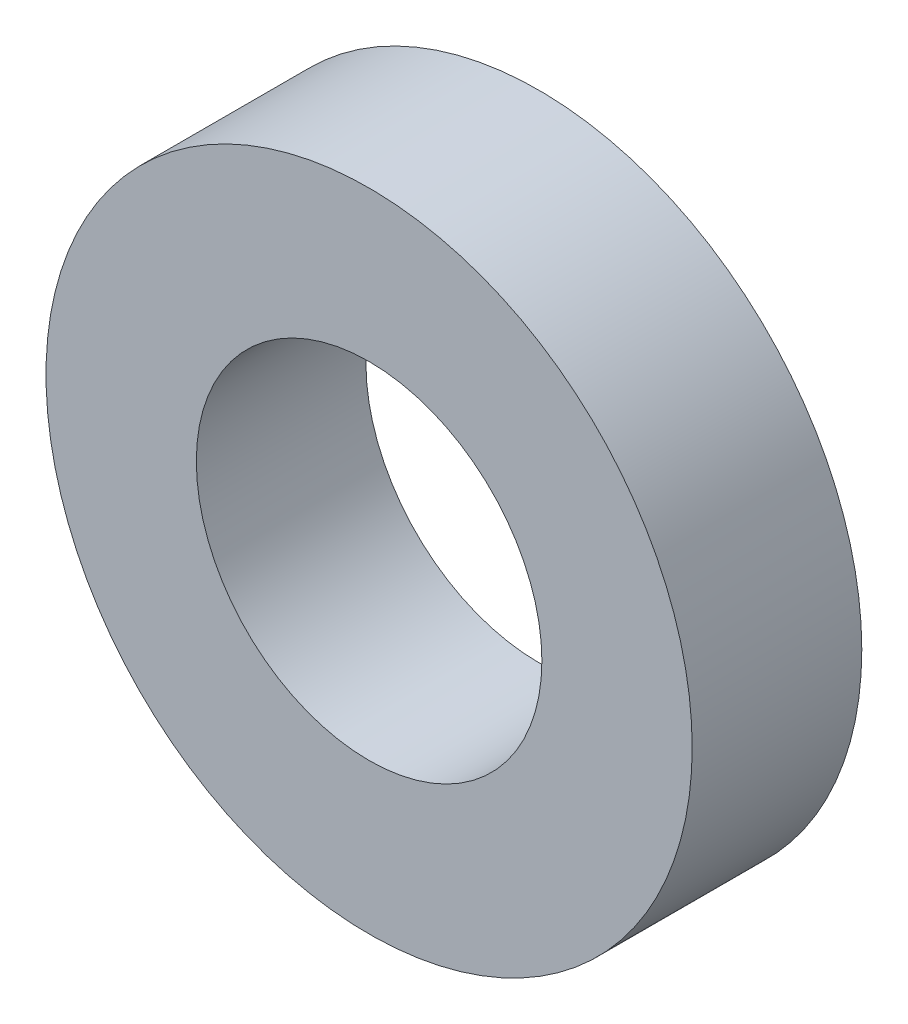
ISO-10303-21;
HEADER;
FILE_DESCRIPTION(('STEP AP214'),'2;1');
FILE_NAME('part.step','',(''),(''),'','','');
FILE_SCHEMA(('AUTOMOTIVE_DESIGN { 1 0 10303 214 1 1 1 1 }'));
ENDSEC;
DATA;
#1=APPLICATION_CONTEXT('core data for automotive mechanical design processes');
#2=APPLICATION_PROTOCOL_DEFINITION('international standard','automotive_design',2000,#1);
#3=PRODUCT_CONTEXT('',#1,'mechanical');
#4=PRODUCT('Part','Part','',(#3));
#5=PRODUCT_RELATED_PRODUCT_CATEGORY('part','',(#4));
#6=PRODUCT_DEFINITION_FORMATION('','',#4);
#7=PRODUCT_DEFINITION_CONTEXT('part definition',#1,'design');
#8=PRODUCT_DEFINITION('design','',#6,#7);
#9=PRODUCT_DEFINITION_SHAPE('','',#8);
#10=(LENGTH_UNIT() NAMED_UNIT(*) SI_UNIT(.MILLI.,.METRE.));
#11=(NAMED_UNIT(*) PLANE_ANGLE_UNIT() SI_UNIT($,.RADIAN.));
#12=(NAMED_UNIT(*) SI_UNIT($,.STERADIAN.) SOLID_ANGLE_UNIT());
#13=UNCERTAINTY_MEASURE_WITH_UNIT(LENGTH_MEASURE(1.E-05),#10,'distance_accuracy_value','');
#14=(GEOMETRIC_REPRESENTATION_CONTEXT(3) GLOBAL_UNCERTAINTY_ASSIGNED_CONTEXT((#13)) GLOBAL_UNIT_ASSIGNED_CONTEXT((#10,
#11,#12)) REPRESENTATION_CONTEXT('',''));
#15=CARTESIAN_POINT('',(0.,0.,0.));
#16=DIRECTION('',(0.,0.,1.));
#17=DIRECTION('',(1.,0.,0.));
#18=AXIS2_PLACEMENT_3D('',#15,#16,#17);
#19=CARTESIAN_POINT('',(0.,0.,20.));
#20=DIRECTION('',(0.,0.,1.));
#21=DIRECTION('',(1.,0.,0.));
#22=AXIS2_PLACEMENT_3D('',#19,#20,#21);
#23=PLANE('',#22);
#24=CARTESIAN_POINT('',(0.,0.,20.));
#25=DIRECTION('',(0.,0.,1.));
#26=DIRECTION('',(1.,0.,0.));
#27=AXIS2_PLACEMENT_3D('',#24,#25,#26);
#28=CIRCLE('',#27,38.1);
#29=CARTESIAN_POINT('',(38.1,0.,20.));
#30=VERTEX_POINT('',#29);
#31=EDGE_CURVE('E10',#30,#30,#28,.T.);
#32=ORIENTED_EDGE('',*,*,#31,.T.);
#33=EDGE_LOOP('',(#32));
#34=FACE_BOUND('',#33,.T.);
#35=CARTESIAN_POINT('',(0.,0.,20.));
#36=DIRECTION('',(0.,0.,1.));
#37=DIRECTION('',(1.,0.,0.));
#38=AXIS2_PLACEMENT_3D('',#35,#36,#37);
#39=CIRCLE('',#38,20.375);
#40=CARTESIAN_POINT('',(20.375,0.,20.));
#41=VERTEX_POINT('',#40);
#42=EDGE_CURVE('E42',#41,#41,#39,.T.);
#43=ORIENTED_EDGE('',*,*,#42,.F.);
#44=EDGE_LOOP('',(#43));
#45=FACE_BOUND('',#44,.T.);
#46=ADVANCED_FACE('F31',(#34,#45),#23,.T.);
#47=CARTESIAN_POINT('',(0.,0.,0.));
#48=DIRECTION('',(0.,0.,1.));
#49=DIRECTION('',(1.,0.,0.));
#50=AXIS2_PLACEMENT_3D('',#47,#48,#49);
#51=PLANE('',#50);
#52=CARTESIAN_POINT('',(0.,0.,0.));
#53=DIRECTION('',(0.,0.,1.));
#54=DIRECTION('',(1.,0.,0.));
#55=AXIS2_PLACEMENT_3D('',#52,#53,#54);
#56=CIRCLE('',#55,38.1);
#57=CARTESIAN_POINT('',(38.1,0.,0.));
#58=VERTEX_POINT('',#57);
#59=EDGE_CURVE('E35',#58,#58,#56,.T.);
#60=ORIENTED_EDGE('',*,*,#59,.F.);
#61=EDGE_LOOP('',(#60));
#62=FACE_BOUND('',#61,.T.);
#63=CARTESIAN_POINT('',(0.,0.,0.));
#64=DIRECTION('',(0.,0.,1.));
#65=DIRECTION('',(1.,0.,0.));
#66=AXIS2_PLACEMENT_3D('',#63,#64,#65);
#67=CIRCLE('',#66,20.375);
#68=CARTESIAN_POINT('',(20.375,0.,0.));
#69=VERTEX_POINT('',#68);
#70=EDGE_CURVE('E44',#69,#69,#67,.T.);
#71=ORIENTED_EDGE('',*,*,#70,.T.);
#72=EDGE_LOOP('',(#71));
#73=FACE_BOUND('',#72,.T.);
#74=ADVANCED_FACE('F54',(#62,#73),#51,.F.);
#75=CARTESIAN_POINT('',(0.,0.,20.));
#76=DIRECTION('',(0.,0.,-1.));
#77=DIRECTION('',(-1.,0.,0.));
#78=AXIS2_PLACEMENT_3D('',#75,#76,#77);
#79=CYLINDRICAL_SURFACE('',#78,38.1);
#80=ORIENTED_EDGE('',*,*,#31,.F.);
#81=EDGE_LOOP('',(#80));
#82=FACE_BOUND('',#81,.T.);
#83=ORIENTED_EDGE('',*,*,#59,.T.);
#84=EDGE_LOOP('',(#83));
#85=FACE_BOUND('',#84,.T.);
#86=ADVANCED_FACE('F33',(#82,#85),#79,.T.);
#87=CARTESIAN_POINT('',(0.,0.,20.));
#88=DIRECTION('',(0.,0.,-1.));
#89=DIRECTION('',(-1.,0.,0.));
#90=AXIS2_PLACEMENT_3D('',#87,#88,#89);
#91=CYLINDRICAL_SURFACE('',#90,20.375);
#92=ORIENTED_EDGE('',*,*,#42,.T.);
#93=EDGE_LOOP('',(#92));
#94=FACE_BOUND('',#93,.T.);
#95=ORIENTED_EDGE('',*,*,#70,.F.);
#96=EDGE_LOOP('',(#95));
#97=FACE_BOUND('',#96,.T.);
#98=ADVANCED_FACE('F50',(#94,#97),#91,.F.);
#99=CLOSED_SHELL('',(#46,#74,#86,#98));
#100=MANIFOLD_SOLID_BREP('B2',#99);
#101=ADVANCED_BREP_SHAPE_REPRESENTATION('',(#18,#100),#14);
#102=SHAPE_DEFINITION_REPRESENTATION(#9,#101);
ENDSEC;
END-ISO-10303-21;
